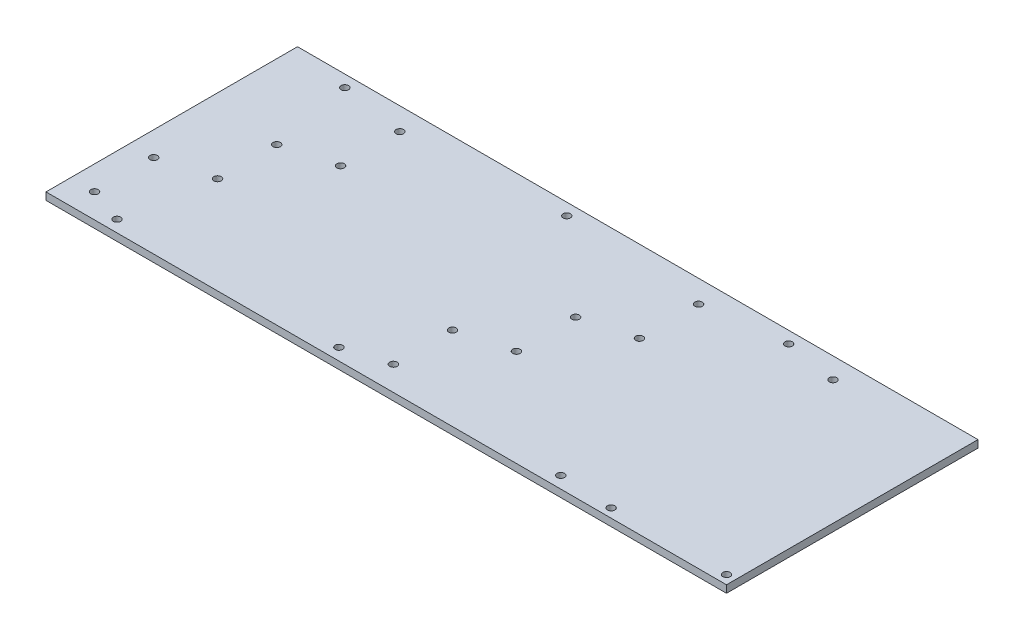
ISO-10303-21;
HEADER;
FILE_DESCRIPTION(('STEP AP214'),'2;1');
FILE_NAME('part.step','',(''),(''),'','','');
FILE_SCHEMA(('AUTOMOTIVE_DESIGN { 1 0 10303 214 1 1 1 1 }'));
ENDSEC;
DATA;
#1=APPLICATION_CONTEXT('core data for automotive mechanical design processes');
#2=APPLICATION_PROTOCOL_DEFINITION('international standard','automotive_design',2000,#1);
#3=PRODUCT_CONTEXT('',#1,'mechanical');
#4=PRODUCT('Part','Part','',(#3));
#5=PRODUCT_RELATED_PRODUCT_CATEGORY('part','',(#4));
#6=PRODUCT_DEFINITION_FORMATION('','',#4);
#7=PRODUCT_DEFINITION_CONTEXT('part definition',#1,'design');
#8=PRODUCT_DEFINITION('design','',#6,#7);
#9=PRODUCT_DEFINITION_SHAPE('','',#8);
#10=(LENGTH_UNIT() NAMED_UNIT(*) SI_UNIT(.MILLI.,.METRE.));
#11=(NAMED_UNIT(*) PLANE_ANGLE_UNIT() SI_UNIT($,.RADIAN.));
#12=(NAMED_UNIT(*) SI_UNIT($,.STERADIAN.) SOLID_ANGLE_UNIT());
#13=UNCERTAINTY_MEASURE_WITH_UNIT(LENGTH_MEASURE(1.E-05),#10,'distance_accuracy_value','');
#14=(GEOMETRIC_REPRESENTATION_CONTEXT(3) GLOBAL_UNCERTAINTY_ASSIGNED_CONTEXT((#13)) GLOBAL_UNIT_ASSIGNED_CONTEXT((#10,
#11,#12)) REPRESENTATION_CONTEXT('',''));
#15=CARTESIAN_POINT('',(0.,0.,0.));
#16=DIRECTION('',(0.,0.,1.));
#17=DIRECTION('',(1.,0.,0.));
#18=AXIS2_PLACEMENT_3D('',#15,#16,#17);
#19=CARTESIAN_POINT('',(0.,5.,0.));
#20=DIRECTION('',(0.,-1.,0.));
#21=DIRECTION('',(0.,0.,-1.));
#22=AXIS2_PLACEMENT_3D('',#19,#20,#21);
#23=PLANE('',#22);
#24=CARTESIAN_POINT('',(-134.7,5.,-19.9999999999999));
#25=DIRECTION('',(0.,1.,0.));
#26=DIRECTION('',(0.,0.,1.));
#27=AXIS2_PLACEMENT_3D('',#24,#25,#26);
#28=CIRCLE('',#27,2.5);
#29=CARTESIAN_POINT('',(-134.7,5.,-17.4999999999999));
#30=VERTEX_POINT('',#29);
#31=EDGE_CURVE('E150',#30,#30,#28,.T.);
#32=ORIENTED_EDGE('',*,*,#31,.F.);
#33=EDGE_LOOP('',(#32));
#34=FACE_BOUND('',#33,.T.);
#35=CARTESIAN_POINT('',(101.3,5.,-69.1700000000015));
#36=DIRECTION('',(0.,1.,0.));
#37=DIRECTION('',(0.,0.,1.));
#38=AXIS2_PLACEMENT_3D('',#35,#36,#37);
#39=CIRCLE('',#38,2.5);
#40=CARTESIAN_POINT('',(101.3,5.,-66.6700000000015));
#41=VERTEX_POINT('',#40);
#42=EDGE_CURVE('E156',#41,#41,#39,.T.);
#43=ORIENTED_EDGE('',*,*,#42,.F.);
#44=EDGE_LOOP('',(#43));
#45=FACE_BOUND('',#44,.T.);
#46=CARTESIAN_POINT('',(-100.7,5.,-69.1700000000015));
#47=DIRECTION('',(0.,1.,0.));
#48=DIRECTION('',(0.,0.,1.));
#49=AXIS2_PLACEMENT_3D('',#46,#47,#48);
#50=CIRCLE('',#49,2.5);
#51=CARTESIAN_POINT('',(-100.7,5.,-66.6700000000015));
#52=VERTEX_POINT('',#51);
#53=EDGE_CURVE('E174',#52,#52,#50,.T.);
#54=ORIENTED_EDGE('',*,*,#53,.F.);
#55=EDGE_LOOP('',(#54));
#56=FACE_BOUND('',#55,.T.);
#57=CARTESIAN_POINT('',(33.3,5.,69.1699999999989));
#58=DIRECTION('',(0.,1.,0.));
#59=DIRECTION('',(0.,0.,1.));
#60=AXIS2_PLACEMENT_3D('',#57,#58,#59);
#61=CIRCLE('',#60,2.5);
#62=CARTESIAN_POINT('',(33.3,5.,71.6699999999989));
#63=VERTEX_POINT('',#62);
#64=EDGE_CURVE('E180',#63,#63,#61,.T.);
#65=ORIENTED_EDGE('',*,*,#64,.F.);
#66=EDGE_LOOP('',(#65));
#67=FACE_BOUND('',#66,.T.);
#68=DIRECTION('',(0.,0.,1.));
#69=VECTOR('',#68,1.);
#70=CARTESIAN_POINT('',(-185.,5.,82.5));
#71=LINE('',#70,#69);
#72=CARTESIAN_POINT('',(-185.,5.,-84.33));
#73=VERTEX_POINT('',#72);
#74=CARTESIAN_POINT('',(-185.,5.,85.67));
#75=VERTEX_POINT('',#74);
#76=EDGE_CURVE('E11',#73,#75,#71,.T.);
#77=ORIENTED_EDGE('',*,*,#76,.T.);
#78=DIRECTION('',(-1.,0.,0.));
#79=VECTOR('',#78,1.);
#80=CARTESIAN_POINT('',(-185.,5.,85.67));
#81=LINE('',#80,#79);
#82=CARTESIAN_POINT('',(275.,5.,85.67));
#83=VERTEX_POINT('',#82);
#84=EDGE_CURVE('E84',#83,#75,#81,.T.);
#85=ORIENTED_EDGE('',*,*,#84,.F.);
#86=DIRECTION('',(0.,0.,1.));
#87=VECTOR('',#86,1.);
#88=CARTESIAN_POINT('',(275.,5.,82.5));
#89=LINE('',#88,#87);
#90=CARTESIAN_POINT('',(275.,5.,-84.33));
#91=VERTEX_POINT('',#90);
#92=EDGE_CURVE('E58',#91,#83,#89,.T.);
#93=ORIENTED_EDGE('',*,*,#92,.F.);
#94=DIRECTION('',(1.,0.,0.));
#95=VECTOR('',#94,1.);
#96=CARTESIAN_POINT('',(-185.,5.,-84.33));
#97=LINE('',#96,#95);
#98=EDGE_CURVE('E96',#73,#91,#97,.T.);
#99=ORIENTED_EDGE('',*,*,#98,.F.);
#100=EDGE_LOOP('',(#77,#85,#93,#99));
#101=FACE_BOUND('',#100,.T.);
#102=CARTESIAN_POINT('',(-168.7,5.,69.169999999999));
#103=DIRECTION('',(0.,1.,0.));
#104=DIRECTION('',(0.,0.,1.));
#105=AXIS2_PLACEMENT_3D('',#102,#103,#104);
#106=CIRCLE('',#105,2.5);
#107=CARTESIAN_POINT('',(-168.7,5.,71.669999999999));
#108=VERTEX_POINT('',#107);
#109=EDGE_CURVE('E198',#108,#108,#106,.T.);
#110=ORIENTED_EDGE('',*,*,#109,.F.);
#111=EDGE_LOOP('',(#110));
#112=FACE_BOUND('',#111,.T.);
#113=CARTESIAN_POINT('',(33.3,5.,29.1699999999989));
#114=DIRECTION('',(0.,1.,0.));
#115=DIRECTION('',(0.,0.,1.));
#116=AXIS2_PLACEMENT_3D('',#113,#114,#115);
#117=CIRCLE('',#116,2.5);
#118=CARTESIAN_POINT('',(33.3,5.,31.6699999999989));
#119=VERTEX_POINT('',#118);
#120=EDGE_CURVE('E192',#119,#119,#117,.T.);
#121=ORIENTED_EDGE('',*,*,#120,.F.);
#122=EDGE_LOOP('',(#121));
#123=FACE_BOUND('',#122,.T.);
#124=CARTESIAN_POINT('',(-168.7,5.,29.169999999999));
#125=DIRECTION('',(0.,1.,0.));
#126=DIRECTION('',(0.,0.,1.));
#127=AXIS2_PLACEMENT_3D('',#124,#125,#126);
#128=CIRCLE('',#127,2.5);
#129=CARTESIAN_POINT('',(-168.7,5.,31.669999999999));
#130=VERTEX_POINT('',#129);
#131=EDGE_CURVE('E186',#130,#130,#128,.T.);
#132=ORIENTED_EDGE('',*,*,#131,.F.);
#133=EDGE_LOOP('',(#132));
#134=FACE_BOUND('',#133,.T.);
#135=CARTESIAN_POINT('',(101.3,5.,-29.1700000000015));
#136=DIRECTION('',(0.,1.,0.));
#137=DIRECTION('',(0.,0.,1.));
#138=AXIS2_PLACEMENT_3D('',#135,#136,#137);
#139=CIRCLE('',#138,2.5);
#140=CARTESIAN_POINT('',(101.3,5.,-26.6700000000015));
#141=VERTEX_POINT('',#140);
#142=EDGE_CURVE('E168',#141,#141,#139,.T.);
#143=ORIENTED_EDGE('',*,*,#142,.F.);
#144=EDGE_LOOP('',(#143));
#145=FACE_BOUND('',#144,.T.);
#146=CARTESIAN_POINT('',(-100.7,5.,-29.1700000000015));
#147=DIRECTION('',(0.,1.,0.));
#148=DIRECTION('',(0.,0.,1.));
#149=AXIS2_PLACEMENT_3D('',#146,#147,#148);
#150=CIRCLE('',#149,2.5);
#151=CARTESIAN_POINT('',(-100.7,5.,-26.6700000000015));
#152=VERTEX_POINT('',#151);
#153=EDGE_CURVE('E162',#152,#152,#150,.T.);
#154=ORIENTED_EDGE('',*,*,#153,.F.);
#155=EDGE_LOOP('',(#154));
#156=FACE_BOUND('',#155,.T.);
#157=CARTESIAN_POINT('',(-134.7,5.,20.0000000000001));
#158=DIRECTION('',(0.,1.,0.));
#159=DIRECTION('',(0.,0.,1.));
#160=AXIS2_PLACEMENT_3D('',#157,#158,#159);
#161=CIRCLE('',#160,2.5);
#162=CARTESIAN_POINT('',(-134.7,5.,22.5000000000001));
#163=VERTEX_POINT('',#162);
#164=EDGE_CURVE('E144',#163,#163,#161,.T.);
#165=ORIENTED_EDGE('',*,*,#164,.F.);
#166=EDGE_LOOP('',(#165));
#167=FACE_BOUND('',#166,.T.);
#168=CARTESIAN_POINT('',(67.3,5.,-20.0000000000013));
#169=DIRECTION('',(0.,1.,0.));
#170=DIRECTION('',(0.,0.,1.));
#171=AXIS2_PLACEMENT_3D('',#168,#169,#170);
#172=CIRCLE('',#171,2.5);
#173=CARTESIAN_POINT('',(67.3,5.,-17.5000000000013));
#174=VERTEX_POINT('',#173);
#175=EDGE_CURVE('E138',#174,#174,#172,.T.);
#176=ORIENTED_EDGE('',*,*,#175,.F.);
#177=EDGE_LOOP('',(#176));
#178=FACE_BOUND('',#177,.T.);
#179=CARTESIAN_POINT('',(67.3,5.,19.9999999999987));
#180=DIRECTION('',(0.,1.,0.));
#181=DIRECTION('',(0.,0.,1.));
#182=AXIS2_PLACEMENT_3D('',#179,#180,#181);
#183=CIRCLE('',#182,2.5);
#184=CARTESIAN_POINT('',(67.3,5.,22.4999999999987));
#185=VERTEX_POINT('',#184);
#186=EDGE_CURVE('E132',#185,#185,#183,.T.);
#187=ORIENTED_EDGE('',*,*,#186,.F.);
#188=EDGE_LOOP('',(#187));
#189=FACE_BOUND('',#188,.T.);
#190=CARTESIAN_POINT('',(269.,5.,79.67));
#191=DIRECTION('',(0.,1.,0.));
#192=DIRECTION('',(0.,0.,1.));
#193=AXIS2_PLACEMENT_3D('',#190,#191,#192);
#194=CIRCLE('',#193,2.5);
#195=CARTESIAN_POINT('',(269.,5.,82.17));
#196=VERTEX_POINT('',#195);
#197=EDGE_CURVE('E118',#196,#196,#194,.T.);
#198=ORIENTED_EDGE('',*,*,#197,.F.);
#199=EDGE_LOOP('',(#198));
#200=FACE_BOUND('',#199,.T.);
#201=CARTESIAN_POINT('',(191.,5.,79.67));
#202=DIRECTION('',(0.,1.,0.));
#203=DIRECTION('',(0.,0.,1.));
#204=AXIS2_PLACEMENT_3D('',#201,#202,#203);
#205=CIRCLE('',#204,2.5);
#206=CARTESIAN_POINT('',(191.,5.,82.17));
#207=VERTEX_POINT('',#206);
#208=EDGE_CURVE('E112',#207,#207,#205,.T.);
#209=ORIENTED_EDGE('',*,*,#208,.F.);
#210=EDGE_LOOP('',(#209));
#211=FACE_BOUND('',#210,.T.);
#212=CARTESIAN_POINT('',(191.,5.,-70.33));
#213=DIRECTION('',(0.,1.,0.));
#214=DIRECTION('',(0.,0.,1.));
#215=AXIS2_PLACEMENT_3D('',#212,#213,#214);
#216=CIRCLE('',#215,2.5);
#217=CARTESIAN_POINT('',(191.,5.,-67.83));
#218=VERTEX_POINT('',#217);
#219=EDGE_CURVE('E106',#218,#218,#216,.T.);
#220=ORIENTED_EDGE('',*,*,#219,.F.);
#221=EDGE_LOOP('',(#220));
#222=FACE_BOUND('',#221,.T.);
#223=CARTESIAN_POINT('',(155.,5.,-76.33));
#224=DIRECTION('',(0.,1.,0.));
#225=DIRECTION('',(0.,0.,1.));
#226=AXIS2_PLACEMENT_3D('',#223,#224,#225);
#227=CIRCLE('',#226,2.5);
#228=CARTESIAN_POINT('',(155.,5.,-73.83));
#229=VERTEX_POINT('',#228);
#230=EDGE_CURVE('E100',#229,#229,#227,.T.);
#231=ORIENTED_EDGE('',*,*,#230,.F.);
#232=EDGE_LOOP('',(#231));
#233=FACE_BOUND('',#232,.T.);
#234=CARTESIAN_POINT('',(155.,5.,77.67));
#235=DIRECTION('',(0.,1.,0.));
#236=DIRECTION('',(0.,0.,1.));
#237=AXIS2_PLACEMENT_3D('',#234,#235,#236);
#238=CIRCLE('',#237,2.5);
#239=CARTESIAN_POINT('',(155.,5.,80.17));
#240=VERTEX_POINT('',#239);
#241=EDGE_CURVE('E241',#240,#240,#238,.T.);
#242=ORIENTED_EDGE('',*,*,#241,.F.);
#243=EDGE_LOOP('',(#242));
#244=FACE_BOUND('',#243,.T.);
#245=CARTESIAN_POINT('',(4.99999999999998,5.,-76.33));
#246=DIRECTION('',(0.,1.,0.));
#247=DIRECTION('',(0.,0.,1.));
#248=AXIS2_PLACEMENT_3D('',#245,#246,#247);
#249=CIRCLE('',#248,2.5);
#250=CARTESIAN_POINT('',(4.99999999999998,5.,-73.83));
#251=VERTEX_POINT('',#250);
#252=EDGE_CURVE('E245',#251,#251,#249,.T.);
#253=ORIENTED_EDGE('',*,*,#252,.F.);
#254=EDGE_LOOP('',(#253));
#255=FACE_BOUND('',#254,.T.);
#256=CARTESIAN_POINT('',(4.99999999999998,5.,77.67));
#257=DIRECTION('',(0.,1.,0.));
#258=DIRECTION('',(0.,0.,1.));
#259=AXIS2_PLACEMENT_3D('',#256,#257,#258);
#260=CIRCLE('',#259,2.5);
#261=CARTESIAN_POINT('',(4.99999999999998,5.,80.17));
#262=VERTEX_POINT('',#261);
#263=EDGE_CURVE('E249',#262,#262,#260,.T.);
#264=ORIENTED_EDGE('',*,*,#263,.F.);
#265=EDGE_LOOP('',(#264));
#266=FACE_BOUND('',#265,.T.);
#267=CARTESIAN_POINT('',(-145.,5.,-76.33));
#268=DIRECTION('',(0.,1.,0.));
#269=DIRECTION('',(0.,0.,1.));
#270=AXIS2_PLACEMENT_3D('',#267,#268,#269);
#271=CIRCLE('',#270,2.5);
#272=CARTESIAN_POINT('',(-145.,5.,-73.83));
#273=VERTEX_POINT('',#272);
#274=EDGE_CURVE('E253',#273,#273,#271,.T.);
#275=ORIENTED_EDGE('',*,*,#274,.F.);
#276=EDGE_LOOP('',(#275));
#277=FACE_BOUND('',#276,.T.);
#278=CARTESIAN_POINT('',(-145.,5.,77.67));
#279=DIRECTION('',(0.,1.,0.));
#280=DIRECTION('',(0.,0.,1.));
#281=AXIS2_PLACEMENT_3D('',#278,#279,#280);
#282=CIRCLE('',#281,2.5);
#283=CARTESIAN_POINT('',(-145.,5.,80.17));
#284=VERTEX_POINT('',#283);
#285=EDGE_CURVE('E256',#284,#284,#282,.T.);
#286=ORIENTED_EDGE('',*,*,#285,.F.);
#287=EDGE_LOOP('',(#286));
#288=FACE_BOUND('',#287,.T.);
#289=ADVANCED_FACE('F37',(#34,#45,#56,#67,#101,#112,#123,#134,#145,#156,#167,#178,#189,#200,
#211,#222,#233,#244,#255,#266,#277,#288),#23,.F.);
#290=CARTESIAN_POINT('',(-185.,5.,82.5));
#291=DIRECTION('',(1.,0.,0.));
#292=DIRECTION('',(0.,0.,-1.));
#293=AXIS2_PLACEMENT_3D('',#290,#291,#292);
#294=PLANE('',#293);
#295=DIRECTION('',(0.,0.,1.));
#296=VECTOR('',#295,1.);
#297=CARTESIAN_POINT('',(-185.,0.,82.5));
#298=LINE('',#297,#296);
#299=CARTESIAN_POINT('',(-185.,0.,-84.33));
#300=VERTEX_POINT('',#299);
#301=CARTESIAN_POINT('',(-185.,0.,85.67));
#302=VERTEX_POINT('',#301);
#303=EDGE_CURVE('E41',#300,#302,#298,.T.);
#304=ORIENTED_EDGE('',*,*,#303,.T.);
#305=DIRECTION('',(0.,-1.,0.));
#306=VECTOR('',#305,1.);
#307=CARTESIAN_POINT('',(-185.,5.,85.67));
#308=LINE('',#307,#306);
#309=EDGE_CURVE('E124',#75,#302,#308,.T.);
#310=ORIENTED_EDGE('',*,*,#309,.F.);
#311=ORIENTED_EDGE('',*,*,#76,.F.);
#312=DIRECTION('',(0.,1.,0.));
#313=VECTOR('',#312,1.);
#314=CARTESIAN_POINT('',(-185.,0.,-84.33));
#315=LINE('',#314,#313);
#316=EDGE_CURVE('E92',#300,#73,#315,.T.);
#317=ORIENTED_EDGE('',*,*,#316,.F.);
#318=EDGE_LOOP('',(#304,#310,#311,#317));
#319=FACE_BOUND('',#318,.T.);
#320=ADVANCED_FACE('F39',(#319),#294,.F.);
#321=CARTESIAN_POINT('',(0.,0.,0.));
#322=DIRECTION('',(0.,-1.,0.));
#323=DIRECTION('',(0.,0.,-1.));
#324=AXIS2_PLACEMENT_3D('',#321,#322,#323);
#325=PLANE('',#324);
#326=CARTESIAN_POINT('',(-145.,0.,77.67));
#327=DIRECTION('',(0.,-1.,0.));
#328=DIRECTION('',(0.,0.,-1.));
#329=AXIS2_PLACEMENT_3D('',#326,#327,#328);
#330=CIRCLE('',#329,2.5);
#331=CARTESIAN_POINT('',(-145.,0.,75.17));
#332=VERTEX_POINT('',#331);
#333=EDGE_CURVE('E258',#332,#332,#330,.T.);
#334=ORIENTED_EDGE('',*,*,#333,.F.);
#335=EDGE_LOOP('',(#334));
#336=FACE_BOUND('',#335,.T.);
#337=CARTESIAN_POINT('',(-145.,0.,-76.33));
#338=DIRECTION('',(0.,-1.,0.));
#339=DIRECTION('',(0.,0.,-1.));
#340=AXIS2_PLACEMENT_3D('',#337,#338,#339);
#341=CIRCLE('',#340,2.5);
#342=CARTESIAN_POINT('',(-145.,0.,-78.83));
#343=VERTEX_POINT('',#342);
#344=EDGE_CURVE('E264',#343,#343,#341,.T.);
#345=ORIENTED_EDGE('',*,*,#344,.F.);
#346=EDGE_LOOP('',(#345));
#347=FACE_BOUND('',#346,.T.);
#348=CARTESIAN_POINT('',(4.99999999999998,0.,77.67));
#349=DIRECTION('',(0.,-1.,0.));
#350=DIRECTION('',(0.,0.,-1.));
#351=AXIS2_PLACEMENT_3D('',#348,#349,#350);
#352=CIRCLE('',#351,2.5);
#353=CARTESIAN_POINT('',(4.99999999999998,0.,75.17));
#354=VERTEX_POINT('',#353);
#355=EDGE_CURVE('E268',#354,#354,#352,.T.);
#356=ORIENTED_EDGE('',*,*,#355,.F.);
#357=EDGE_LOOP('',(#356));
#358=FACE_BOUND('',#357,.T.);
#359=CARTESIAN_POINT('',(4.99999999999998,0.,-76.33));
#360=DIRECTION('',(0.,-1.,0.));
#361=DIRECTION('',(0.,0.,-1.));
#362=AXIS2_PLACEMENT_3D('',#359,#360,#361);
#363=CIRCLE('',#362,2.5);
#364=CARTESIAN_POINT('',(4.99999999999998,0.,-78.83));
#365=VERTEX_POINT('',#364);
#366=EDGE_CURVE('E272',#365,#365,#363,.T.);
#367=ORIENTED_EDGE('',*,*,#366,.F.);
#368=EDGE_LOOP('',(#367));
#369=FACE_BOUND('',#368,.T.);
#370=CARTESIAN_POINT('',(155.,0.,77.67));
#371=DIRECTION('',(0.,-1.,0.));
#372=DIRECTION('',(0.,0.,-1.));
#373=AXIS2_PLACEMENT_3D('',#370,#371,#372);
#374=CIRCLE('',#373,2.5);
#375=CARTESIAN_POINT('',(155.,0.,75.17));
#376=VERTEX_POINT('',#375);
#377=EDGE_CURVE('E276',#376,#376,#374,.T.);
#378=ORIENTED_EDGE('',*,*,#377,.F.);
#379=EDGE_LOOP('',(#378));
#380=FACE_BOUND('',#379,.T.);
#381=CARTESIAN_POINT('',(155.,0.,-76.33));
#382=DIRECTION('',(0.,-1.,0.));
#383=DIRECTION('',(0.,0.,-1.));
#384=AXIS2_PLACEMENT_3D('',#381,#382,#383);
#385=CIRCLE('',#384,2.5);
#386=CARTESIAN_POINT('',(155.,0.,-78.83));
#387=VERTEX_POINT('',#386);
#388=EDGE_CURVE('E97',#387,#387,#385,.T.);
#389=ORIENTED_EDGE('',*,*,#388,.F.);
#390=EDGE_LOOP('',(#389));
#391=FACE_BOUND('',#390,.T.);
#392=CARTESIAN_POINT('',(191.,0.,-70.33));
#393=DIRECTION('',(0.,-1.,0.));
#394=DIRECTION('',(0.,0.,-1.));
#395=AXIS2_PLACEMENT_3D('',#392,#393,#394);
#396=CIRCLE('',#395,2.5);
#397=CARTESIAN_POINT('',(191.,0.,-72.83));
#398=VERTEX_POINT('',#397);
#399=EDGE_CURVE('E109',#398,#398,#396,.T.);
#400=ORIENTED_EDGE('',*,*,#399,.F.);
#401=EDGE_LOOP('',(#400));
#402=FACE_BOUND('',#401,.T.);
#403=CARTESIAN_POINT('',(191.,0.,79.67));
#404=DIRECTION('',(0.,-1.,0.));
#405=DIRECTION('',(0.,0.,-1.));
#406=AXIS2_PLACEMENT_3D('',#403,#404,#405);
#407=CIRCLE('',#406,2.5);
#408=CARTESIAN_POINT('',(191.,0.,77.17));
#409=VERTEX_POINT('',#408);
#410=EDGE_CURVE('E115',#409,#409,#407,.T.);
#411=ORIENTED_EDGE('',*,*,#410,.F.);
#412=EDGE_LOOP('',(#411));
#413=FACE_BOUND('',#412,.T.);
#414=CARTESIAN_POINT('',(269.,0.,79.67));
#415=DIRECTION('',(0.,-1.,0.));
#416=DIRECTION('',(0.,0.,-1.));
#417=AXIS2_PLACEMENT_3D('',#414,#415,#416);
#418=CIRCLE('',#417,2.5);
#419=CARTESIAN_POINT('',(269.,0.,77.17));
#420=VERTEX_POINT('',#419);
#421=EDGE_CURVE('E121',#420,#420,#418,.T.);
#422=ORIENTED_EDGE('',*,*,#421,.F.);
#423=EDGE_LOOP('',(#422));
#424=FACE_BOUND('',#423,.T.);
#425=CARTESIAN_POINT('',(67.3,0.,19.9999999999987));
#426=DIRECTION('',(0.,-1.,0.));
#427=DIRECTION('',(0.,0.,-1.));
#428=AXIS2_PLACEMENT_3D('',#425,#426,#427);
#429=CIRCLE('',#428,2.5);
#430=CARTESIAN_POINT('',(67.3,0.,17.4999999999987));
#431=VERTEX_POINT('',#430);
#432=EDGE_CURVE('E135',#431,#431,#429,.T.);
#433=ORIENTED_EDGE('',*,*,#432,.F.);
#434=EDGE_LOOP('',(#433));
#435=FACE_BOUND('',#434,.T.);
#436=CARTESIAN_POINT('',(67.3,0.,-20.0000000000013));
#437=DIRECTION('',(0.,-1.,0.));
#438=DIRECTION('',(0.,0.,-1.));
#439=AXIS2_PLACEMENT_3D('',#436,#437,#438);
#440=CIRCLE('',#439,2.5);
#441=CARTESIAN_POINT('',(67.3,0.,-22.5000000000013));
#442=VERTEX_POINT('',#441);
#443=EDGE_CURVE('E141',#442,#442,#440,.T.);
#444=ORIENTED_EDGE('',*,*,#443,.F.);
#445=EDGE_LOOP('',(#444));
#446=FACE_BOUND('',#445,.T.);
#447=CARTESIAN_POINT('',(-134.7,0.,20.0000000000001));
#448=DIRECTION('',(0.,-1.,0.));
#449=DIRECTION('',(0.,0.,-1.));
#450=AXIS2_PLACEMENT_3D('',#447,#448,#449);
#451=CIRCLE('',#450,2.5);
#452=CARTESIAN_POINT('',(-134.7,0.,17.5000000000001));
#453=VERTEX_POINT('',#452);
#454=EDGE_CURVE('E147',#453,#453,#451,.T.);
#455=ORIENTED_EDGE('',*,*,#454,.F.);
#456=EDGE_LOOP('',(#455));
#457=FACE_BOUND('',#456,.T.);
#458=CARTESIAN_POINT('',(-134.7,0.,-19.9999999999999));
#459=DIRECTION('',(0.,-1.,0.));
#460=DIRECTION('',(0.,0.,-1.));
#461=AXIS2_PLACEMENT_3D('',#458,#459,#460);
#462=CIRCLE('',#461,2.5);
#463=CARTESIAN_POINT('',(-134.7,0.,-22.4999999999999));
#464=VERTEX_POINT('',#463);
#465=EDGE_CURVE('E153',#464,#464,#462,.T.);
#466=ORIENTED_EDGE('',*,*,#465,.F.);
#467=EDGE_LOOP('',(#466));
#468=FACE_BOUND('',#467,.T.);
#469=CARTESIAN_POINT('',(101.3,0.,-69.1700000000015));
#470=DIRECTION('',(0.,-1.,0.));
#471=DIRECTION('',(0.,0.,-1.));
#472=AXIS2_PLACEMENT_3D('',#469,#470,#471);
#473=CIRCLE('',#472,2.5);
#474=CARTESIAN_POINT('',(101.3,0.,-71.6700000000015));
#475=VERTEX_POINT('',#474);
#476=EDGE_CURVE('E159',#475,#475,#473,.T.);
#477=ORIENTED_EDGE('',*,*,#476,.F.);
#478=EDGE_LOOP('',(#477));
#479=FACE_BOUND('',#478,.T.);
#480=CARTESIAN_POINT('',(-100.7,0.,-29.1700000000015));
#481=DIRECTION('',(0.,-1.,0.));
#482=DIRECTION('',(0.,0.,-1.));
#483=AXIS2_PLACEMENT_3D('',#480,#481,#482);
#484=CIRCLE('',#483,2.5);
#485=CARTESIAN_POINT('',(-100.7,0.,-31.6700000000015));
#486=VERTEX_POINT('',#485);
#487=EDGE_CURVE('E165',#486,#486,#484,.T.);
#488=ORIENTED_EDGE('',*,*,#487,.F.);
#489=EDGE_LOOP('',(#488));
#490=FACE_BOUND('',#489,.T.);
#491=CARTESIAN_POINT('',(101.3,0.,-29.1700000000015));
#492=DIRECTION('',(0.,-1.,0.));
#493=DIRECTION('',(0.,0.,-1.));
#494=AXIS2_PLACEMENT_3D('',#491,#492,#493);
#495=CIRCLE('',#494,2.5);
#496=CARTESIAN_POINT('',(101.3,0.,-31.6700000000015));
#497=VERTEX_POINT('',#496);
#498=EDGE_CURVE('E171',#497,#497,#495,.T.);
#499=ORIENTED_EDGE('',*,*,#498,.F.);
#500=EDGE_LOOP('',(#499));
#501=FACE_BOUND('',#500,.T.);
#502=CARTESIAN_POINT('',(-100.7,0.,-69.1700000000015));
#503=DIRECTION('',(0.,-1.,0.));
#504=DIRECTION('',(0.,0.,-1.));
#505=AXIS2_PLACEMENT_3D('',#502,#503,#504);
#506=CIRCLE('',#505,2.5);
#507=CARTESIAN_POINT('',(-100.7,0.,-71.6700000000015));
#508=VERTEX_POINT('',#507);
#509=EDGE_CURVE('E177',#508,#508,#506,.T.);
#510=ORIENTED_EDGE('',*,*,#509,.F.);
#511=EDGE_LOOP('',(#510));
#512=FACE_BOUND('',#511,.T.);
#513=CARTESIAN_POINT('',(33.3,0.,69.1699999999989));
#514=DIRECTION('',(0.,-1.,0.));
#515=DIRECTION('',(0.,0.,-1.));
#516=AXIS2_PLACEMENT_3D('',#513,#514,#515);
#517=CIRCLE('',#516,2.5);
#518=CARTESIAN_POINT('',(33.3,0.,66.6699999999989));
#519=VERTEX_POINT('',#518);
#520=EDGE_CURVE('E183',#519,#519,#517,.T.);
#521=ORIENTED_EDGE('',*,*,#520,.F.);
#522=EDGE_LOOP('',(#521));
#523=FACE_BOUND('',#522,.T.);
#524=CARTESIAN_POINT('',(-168.7,0.,29.169999999999));
#525=DIRECTION('',(0.,-1.,0.));
#526=DIRECTION('',(0.,0.,-1.));
#527=AXIS2_PLACEMENT_3D('',#524,#525,#526);
#528=CIRCLE('',#527,2.5);
#529=CARTESIAN_POINT('',(-168.7,0.,26.669999999999));
#530=VERTEX_POINT('',#529);
#531=EDGE_CURVE('E189',#530,#530,#528,.T.);
#532=ORIENTED_EDGE('',*,*,#531,.F.);
#533=EDGE_LOOP('',(#532));
#534=FACE_BOUND('',#533,.T.);
#535=CARTESIAN_POINT('',(33.3,0.,29.1699999999989));
#536=DIRECTION('',(0.,-1.,0.));
#537=DIRECTION('',(0.,0.,-1.));
#538=AXIS2_PLACEMENT_3D('',#535,#536,#537);
#539=CIRCLE('',#538,2.5);
#540=CARTESIAN_POINT('',(33.3,0.,26.6699999999989));
#541=VERTEX_POINT('',#540);
#542=EDGE_CURVE('E195',#541,#541,#539,.T.);
#543=ORIENTED_EDGE('',*,*,#542,.F.);
#544=EDGE_LOOP('',(#543));
#545=FACE_BOUND('',#544,.T.);
#546=CARTESIAN_POINT('',(-168.7,0.,69.169999999999));
#547=DIRECTION('',(0.,-1.,0.));
#548=DIRECTION('',(0.,0.,-1.));
#549=AXIS2_PLACEMENT_3D('',#546,#547,#548);
#550=CIRCLE('',#549,2.5);
#551=CARTESIAN_POINT('',(-168.7,0.,66.669999999999));
#552=VERTEX_POINT('',#551);
#553=EDGE_CURVE('E201',#552,#552,#550,.T.);
#554=ORIENTED_EDGE('',*,*,#553,.F.);
#555=EDGE_LOOP('',(#554));
#556=FACE_BOUND('',#555,.T.);
#557=ORIENTED_EDGE('',*,*,#303,.F.);
#558=DIRECTION('',(-1.,0.,0.));
#559=VECTOR('',#558,1.);
#560=CARTESIAN_POINT('',(275.,0.,-84.33));
#561=LINE('',#560,#559);
#562=CARTESIAN_POINT('',(275.,0.,-84.33));
#563=VERTEX_POINT('',#562);
#564=EDGE_CURVE('E87',#563,#300,#561,.T.);
#565=ORIENTED_EDGE('',*,*,#564,.F.);
#566=DIRECTION('',(0.,0.,-1.));
#567=VECTOR('',#566,1.);
#568=CARTESIAN_POINT('',(275.,0.,82.5));
#569=LINE('',#568,#567);
#570=CARTESIAN_POINT('',(275.,0.,85.67));
#571=VERTEX_POINT('',#570);
#572=EDGE_CURVE('E75',#571,#563,#569,.T.);
#573=ORIENTED_EDGE('',*,*,#572,.F.);
#574=DIRECTION('',(1.,0.,0.));
#575=VECTOR('',#574,1.);
#576=CARTESIAN_POINT('',(-185.,0.,85.67));
#577=LINE('',#576,#575);
#578=EDGE_CURVE('E127',#302,#571,#577,.T.);
#579=ORIENTED_EDGE('',*,*,#578,.F.);
#580=EDGE_LOOP('',(#557,#565,#573,#579));
#581=FACE_BOUND('',#580,.T.);
#582=ADVANCED_FACE('F88',(#336,#347,#358,#369,#380,#391,#402,#413,#424,#435,#446,#457,#468,#479,
#490,#501,#512,#523,#534,#545,#556,#581),#325,.T.);
#583=CARTESIAN_POINT('',(-168.7,5.,69.169999999999));
#584=DIRECTION('',(0.,1.,0.));
#585=DIRECTION('',(0.,0.,1.));
#586=AXIS2_PLACEMENT_3D('',#583,#584,#585);
#587=CYLINDRICAL_SURFACE('',#586,2.5);
#588=ORIENTED_EDGE('',*,*,#109,.T.);
#589=EDGE_LOOP('',(#588));
#590=FACE_BOUND('',#589,.T.);
#591=ORIENTED_EDGE('',*,*,#553,.T.);
#592=EDGE_LOOP('',(#591));
#593=FACE_BOUND('',#592,.T.);
#594=ADVANCED_FACE('F288',(#590,#593),#587,.F.);
#595=CARTESIAN_POINT('',(33.3,5.,29.1699999999989));
#596=DIRECTION('',(0.,1.,0.));
#597=DIRECTION('',(0.,0.,1.));
#598=AXIS2_PLACEMENT_3D('',#595,#596,#597);
#599=CYLINDRICAL_SURFACE('',#598,2.5);
#600=ORIENTED_EDGE('',*,*,#120,.T.);
#601=EDGE_LOOP('',(#600));
#602=FACE_BOUND('',#601,.T.);
#603=ORIENTED_EDGE('',*,*,#542,.T.);
#604=EDGE_LOOP('',(#603));
#605=FACE_BOUND('',#604,.T.);
#606=ADVANCED_FACE('F319',(#602,#605),#599,.F.);
#607=CARTESIAN_POINT('',(-168.7,5.,29.169999999999));
#608=DIRECTION('',(0.,1.,0.));
#609=DIRECTION('',(0.,0.,1.));
#610=AXIS2_PLACEMENT_3D('',#607,#608,#609);
#611=CYLINDRICAL_SURFACE('',#610,2.5);
#612=ORIENTED_EDGE('',*,*,#131,.T.);
#613=EDGE_LOOP('',(#612));
#614=FACE_BOUND('',#613,.T.);
#615=ORIENTED_EDGE('',*,*,#531,.T.);
#616=EDGE_LOOP('',(#615));
#617=FACE_BOUND('',#616,.T.);
#618=ADVANCED_FACE('F321',(#614,#617),#611,.F.);
#619=CARTESIAN_POINT('',(33.3,5.,69.1699999999989));
#620=DIRECTION('',(0.,1.,0.));
#621=DIRECTION('',(0.,0.,1.));
#622=AXIS2_PLACEMENT_3D('',#619,#620,#621);
#623=CYLINDRICAL_SURFACE('',#622,2.5);
#624=ORIENTED_EDGE('',*,*,#64,.T.);
#625=EDGE_LOOP('',(#624));
#626=FACE_BOUND('',#625,.T.);
#627=ORIENTED_EDGE('',*,*,#520,.T.);
#628=EDGE_LOOP('',(#627));
#629=FACE_BOUND('',#628,.T.);
#630=ADVANCED_FACE('F328',(#626,#629),#623,.F.);
#631=CARTESIAN_POINT('',(-100.7,5.,-69.1700000000015));
#632=DIRECTION('',(0.,1.,0.));
#633=DIRECTION('',(0.,0.,1.));
#634=AXIS2_PLACEMENT_3D('',#631,#632,#633);
#635=CYLINDRICAL_SURFACE('',#634,2.5);
#636=ORIENTED_EDGE('',*,*,#53,.T.);
#637=EDGE_LOOP('',(#636));
#638=FACE_BOUND('',#637,.T.);
#639=ORIENTED_EDGE('',*,*,#509,.T.);
#640=EDGE_LOOP('',(#639));
#641=FACE_BOUND('',#640,.T.);
#642=ADVANCED_FACE('F336',(#638,#641),#635,.F.);
#643=CARTESIAN_POINT('',(101.3,5.,-29.1700000000015));
#644=DIRECTION('',(0.,1.,0.));
#645=DIRECTION('',(0.,0.,1.));
#646=AXIS2_PLACEMENT_3D('',#643,#644,#645);
#647=CYLINDRICAL_SURFACE('',#646,2.5);
#648=ORIENTED_EDGE('',*,*,#142,.T.);
#649=EDGE_LOOP('',(#648));
#650=FACE_BOUND('',#649,.T.);
#651=ORIENTED_EDGE('',*,*,#498,.T.);
#652=EDGE_LOOP('',(#651));
#653=FACE_BOUND('',#652,.T.);
#654=ADVANCED_FACE('F340',(#650,#653),#647,.F.);
#655=CARTESIAN_POINT('',(-100.7,5.,-29.1700000000015));
#656=DIRECTION('',(0.,1.,0.));
#657=DIRECTION('',(0.,0.,1.));
#658=AXIS2_PLACEMENT_3D('',#655,#656,#657);
#659=CYLINDRICAL_SURFACE('',#658,2.5);
#660=ORIENTED_EDGE('',*,*,#153,.T.);
#661=EDGE_LOOP('',(#660));
#662=FACE_BOUND('',#661,.T.);
#663=ORIENTED_EDGE('',*,*,#487,.T.);
#664=EDGE_LOOP('',(#663));
#665=FACE_BOUND('',#664,.T.);
#666=ADVANCED_FACE('F344',(#662,#665),#659,.F.);
#667=CARTESIAN_POINT('',(101.3,5.,-69.1700000000015));
#668=DIRECTION('',(0.,1.,0.));
#669=DIRECTION('',(0.,0.,1.));
#670=AXIS2_PLACEMENT_3D('',#667,#668,#669);
#671=CYLINDRICAL_SURFACE('',#670,2.5);
#672=ORIENTED_EDGE('',*,*,#42,.T.);
#673=EDGE_LOOP('',(#672));
#674=FACE_BOUND('',#673,.T.);
#675=ORIENTED_EDGE('',*,*,#476,.T.);
#676=EDGE_LOOP('',(#675));
#677=FACE_BOUND('',#676,.T.);
#678=ADVANCED_FACE('F348',(#674,#677),#671,.F.);
#679=CARTESIAN_POINT('',(-134.7,5.,-19.9999999999999));
#680=DIRECTION('',(0.,1.,0.));
#681=DIRECTION('',(0.,0.,1.));
#682=AXIS2_PLACEMENT_3D('',#679,#680,#681);
#683=CYLINDRICAL_SURFACE('',#682,2.5);
#684=ORIENTED_EDGE('',*,*,#31,.T.);
#685=EDGE_LOOP('',(#684));
#686=FACE_BOUND('',#685,.T.);
#687=ORIENTED_EDGE('',*,*,#465,.T.);
#688=EDGE_LOOP('',(#687));
#689=FACE_BOUND('',#688,.T.);
#690=ADVANCED_FACE('F352',(#686,#689),#683,.F.);
#691=CARTESIAN_POINT('',(-134.7,5.,20.0000000000001));
#692=DIRECTION('',(0.,1.,0.));
#693=DIRECTION('',(0.,0.,1.));
#694=AXIS2_PLACEMENT_3D('',#691,#692,#693);
#695=CYLINDRICAL_SURFACE('',#694,2.5);
#696=ORIENTED_EDGE('',*,*,#164,.T.);
#697=EDGE_LOOP('',(#696));
#698=FACE_BOUND('',#697,.T.);
#699=ORIENTED_EDGE('',*,*,#454,.T.);
#700=EDGE_LOOP('',(#699));
#701=FACE_BOUND('',#700,.T.);
#702=ADVANCED_FACE('F356',(#698,#701),#695,.F.);
#703=CARTESIAN_POINT('',(67.3,5.,-20.0000000000013));
#704=DIRECTION('',(0.,1.,0.));
#705=DIRECTION('',(0.,0.,1.));
#706=AXIS2_PLACEMENT_3D('',#703,#704,#705);
#707=CYLINDRICAL_SURFACE('',#706,2.5);
#708=ORIENTED_EDGE('',*,*,#175,.T.);
#709=EDGE_LOOP('',(#708));
#710=FACE_BOUND('',#709,.T.);
#711=ORIENTED_EDGE('',*,*,#443,.T.);
#712=EDGE_LOOP('',(#711));
#713=FACE_BOUND('',#712,.T.);
#714=ADVANCED_FACE('F360',(#710,#713),#707,.F.);
#715=CARTESIAN_POINT('',(67.3,5.,19.9999999999987));
#716=DIRECTION('',(0.,1.,0.));
#717=DIRECTION('',(0.,0.,1.));
#718=AXIS2_PLACEMENT_3D('',#715,#716,#717);
#719=CYLINDRICAL_SURFACE('',#718,2.5);
#720=ORIENTED_EDGE('',*,*,#186,.T.);
#721=EDGE_LOOP('',(#720));
#722=FACE_BOUND('',#721,.T.);
#723=ORIENTED_EDGE('',*,*,#432,.T.);
#724=EDGE_LOOP('',(#723));
#725=FACE_BOUND('',#724,.T.);
#726=ADVANCED_FACE('F364',(#722,#725),#719,.F.);
#727=CARTESIAN_POINT('',(275.,0.,0.));
#728=DIRECTION('',(1.,0.,0.));
#729=DIRECTION('',(0.,0.,-1.));
#730=AXIS2_PLACEMENT_3D('',#727,#728,#729);
#731=PLANE('',#730);
#732=ORIENTED_EDGE('',*,*,#92,.T.);
#733=DIRECTION('',(0.,1.,0.));
#734=VECTOR('',#733,1.);
#735=CARTESIAN_POINT('',(275.,5.,85.67));
#736=LINE('',#735,#734);
#737=EDGE_CURVE('E80',#571,#83,#736,.T.);
#738=ORIENTED_EDGE('',*,*,#737,.F.);
#739=ORIENTED_EDGE('',*,*,#572,.T.);
#740=DIRECTION('',(0.,-1.,0.));
#741=VECTOR('',#740,1.);
#742=CARTESIAN_POINT('',(275.,5.,-84.33));
#743=LINE('',#742,#741);
#744=EDGE_CURVE('E79',#91,#563,#743,.T.);
#745=ORIENTED_EDGE('',*,*,#744,.F.);
#746=EDGE_LOOP('',(#732,#738,#739,#745));
#747=FACE_BOUND('',#746,.T.);
#748=ADVANCED_FACE('F77',(#747),#731,.T.);
#749=CARTESIAN_POINT('',(0.,0.,85.67));
#750=DIRECTION('',(0.,0.,1.));
#751=DIRECTION('',(1.,0.,0.));
#752=AXIS2_PLACEMENT_3D('',#749,#750,#751);
#753=PLANE('',#752);
#754=ORIENTED_EDGE('',*,*,#309,.T.);
#755=ORIENTED_EDGE('',*,*,#578,.T.);
#756=ORIENTED_EDGE('',*,*,#737,.T.);
#757=ORIENTED_EDGE('',*,*,#84,.T.);
#758=EDGE_LOOP('',(#754,#755,#756,#757));
#759=FACE_BOUND('',#758,.T.);
#760=ADVANCED_FACE('F208',(#759),#753,.T.);
#761=CARTESIAN_POINT('',(269.,5.,79.67));
#762=DIRECTION('',(0.,1.,0.));
#763=DIRECTION('',(0.,0.,1.));
#764=AXIS2_PLACEMENT_3D('',#761,#762,#763);
#765=CYLINDRICAL_SURFACE('',#764,2.5);
#766=ORIENTED_EDGE('',*,*,#197,.T.);
#767=EDGE_LOOP('',(#766));
#768=FACE_BOUND('',#767,.T.);
#769=ORIENTED_EDGE('',*,*,#421,.T.);
#770=EDGE_LOOP('',(#769));
#771=FACE_BOUND('',#770,.T.);
#772=ADVANCED_FACE('F373',(#768,#771),#765,.F.);
#773=CARTESIAN_POINT('',(191.,5.,79.67));
#774=DIRECTION('',(0.,1.,0.));
#775=DIRECTION('',(0.,0.,1.));
#776=AXIS2_PLACEMENT_3D('',#773,#774,#775);
#777=CYLINDRICAL_SURFACE('',#776,2.5);
#778=ORIENTED_EDGE('',*,*,#208,.T.);
#779=EDGE_LOOP('',(#778));
#780=FACE_BOUND('',#779,.T.);
#781=ORIENTED_EDGE('',*,*,#410,.T.);
#782=EDGE_LOOP('',(#781));
#783=FACE_BOUND('',#782,.T.);
#784=ADVANCED_FACE('F376',(#780,#783),#777,.F.);
#785=CARTESIAN_POINT('',(191.,5.,-70.33));
#786=DIRECTION('',(0.,1.,0.));
#787=DIRECTION('',(0.,0.,1.));
#788=AXIS2_PLACEMENT_3D('',#785,#786,#787);
#789=CYLINDRICAL_SURFACE('',#788,2.5);
#790=ORIENTED_EDGE('',*,*,#219,.T.);
#791=EDGE_LOOP('',(#790));
#792=FACE_BOUND('',#791,.T.);
#793=ORIENTED_EDGE('',*,*,#399,.T.);
#794=EDGE_LOOP('',(#793));
#795=FACE_BOUND('',#794,.T.);
#796=ADVANCED_FACE('F380',(#792,#795),#789,.F.);
#797=CARTESIAN_POINT('',(0.,0.,-84.33));
#798=DIRECTION('',(0.,0.,-1.));
#799=DIRECTION('',(-1.,0.,0.));
#800=AXIS2_PLACEMENT_3D('',#797,#798,#799);
#801=PLANE('',#800);
#802=ORIENTED_EDGE('',*,*,#744,.T.);
#803=ORIENTED_EDGE('',*,*,#564,.T.);
#804=ORIENTED_EDGE('',*,*,#316,.T.);
#805=ORIENTED_EDGE('',*,*,#98,.T.);
#806=EDGE_LOOP('',(#802,#803,#804,#805));
#807=FACE_BOUND('',#806,.T.);
#808=ADVANCED_FACE('F95',(#807),#801,.T.);
#809=CARTESIAN_POINT('',(155.,5.,-76.33));
#810=DIRECTION('',(0.,1.,0.));
#811=DIRECTION('',(0.,0.,1.));
#812=AXIS2_PLACEMENT_3D('',#809,#810,#811);
#813=CYLINDRICAL_SURFACE('',#812,2.5);
#814=ORIENTED_EDGE('',*,*,#230,.T.);
#815=EDGE_LOOP('',(#814));
#816=FACE_BOUND('',#815,.T.);
#817=ORIENTED_EDGE('',*,*,#388,.T.);
#818=EDGE_LOOP('',(#817));
#819=FACE_BOUND('',#818,.T.);
#820=ADVANCED_FACE('F279',(#816,#819),#813,.F.);
#821=CARTESIAN_POINT('',(155.,5.,77.67));
#822=DIRECTION('',(0.,1.,0.));
#823=DIRECTION('',(0.,0.,1.));
#824=AXIS2_PLACEMENT_3D('',#821,#822,#823);
#825=CYLINDRICAL_SURFACE('',#824,2.5);
#826=ORIENTED_EDGE('',*,*,#241,.T.);
#827=EDGE_LOOP('',(#826));
#828=FACE_BOUND('',#827,.T.);
#829=ORIENTED_EDGE('',*,*,#377,.T.);
#830=EDGE_LOOP('',(#829));
#831=FACE_BOUND('',#830,.T.);
#832=ADVANCED_FACE('F282',(#828,#831),#825,.F.);
#833=CARTESIAN_POINT('',(4.99999999999998,5.,-76.33));
#834=DIRECTION('',(0.,1.,0.));
#835=DIRECTION('',(0.,0.,1.));
#836=AXIS2_PLACEMENT_3D('',#833,#834,#835);
#837=CYLINDRICAL_SURFACE('',#836,2.5);
#838=ORIENTED_EDGE('',*,*,#252,.T.);
#839=EDGE_LOOP('',(#838));
#840=FACE_BOUND('',#839,.T.);
#841=ORIENTED_EDGE('',*,*,#366,.T.);
#842=EDGE_LOOP('',(#841));
#843=FACE_BOUND('',#842,.T.);
#844=ADVANCED_FACE('F389',(#840,#843),#837,.F.);
#845=CARTESIAN_POINT('',(4.99999999999998,5.,77.67));
#846=DIRECTION('',(0.,1.,0.));
#847=DIRECTION('',(0.,0.,1.));
#848=AXIS2_PLACEMENT_3D('',#845,#846,#847);
#849=CYLINDRICAL_SURFACE('',#848,2.5);
#850=ORIENTED_EDGE('',*,*,#263,.T.);
#851=EDGE_LOOP('',(#850));
#852=FACE_BOUND('',#851,.T.);
#853=ORIENTED_EDGE('',*,*,#355,.T.);
#854=EDGE_LOOP('',(#853));
#855=FACE_BOUND('',#854,.T.);
#856=ADVANCED_FACE('F393',(#852,#855),#849,.F.);
#857=CARTESIAN_POINT('',(-145.,5.,-76.33));
#858=DIRECTION('',(0.,1.,0.));
#859=DIRECTION('',(0.,0.,1.));
#860=AXIS2_PLACEMENT_3D('',#857,#858,#859);
#861=CYLINDRICAL_SURFACE('',#860,2.5);
#862=ORIENTED_EDGE('',*,*,#274,.T.);
#863=EDGE_LOOP('',(#862));
#864=FACE_BOUND('',#863,.T.);
#865=ORIENTED_EDGE('',*,*,#344,.T.);
#866=EDGE_LOOP('',(#865));
#867=FACE_BOUND('',#866,.T.);
#868=ADVANCED_FACE('F397',(#864,#867),#861,.F.);
#869=CARTESIAN_POINT('',(-145.,5.,77.67));
#870=DIRECTION('',(0.,1.,0.));
#871=DIRECTION('',(0.,0.,1.));
#872=AXIS2_PLACEMENT_3D('',#869,#870,#871);
#873=CYLINDRICAL_SURFACE('',#872,2.5);
#874=ORIENTED_EDGE('',*,*,#285,.T.);
#875=EDGE_LOOP('',(#874));
#876=FACE_BOUND('',#875,.T.);
#877=ORIENTED_EDGE('',*,*,#333,.T.);
#878=EDGE_LOOP('',(#877));
#879=FACE_BOUND('',#878,.T.);
#880=ADVANCED_FACE('F401',(#876,#879),#873,.F.);
#881=CLOSED_SHELL('',(#289,#320,#582,#594,#606,#618,#630,#642,#654,#666,#678,#690,#702,#714,
#726,#748,#760,#772,#784,#796,#808,#820,#832,#844,#856,#868,#880));
#882=MANIFOLD_SOLID_BREP('B2',#881);
#883=ADVANCED_BREP_SHAPE_REPRESENTATION('',(#18,#882),#14);
#884=SHAPE_DEFINITION_REPRESENTATION(#9,#883);
ENDSEC;
END-ISO-10303-21;
